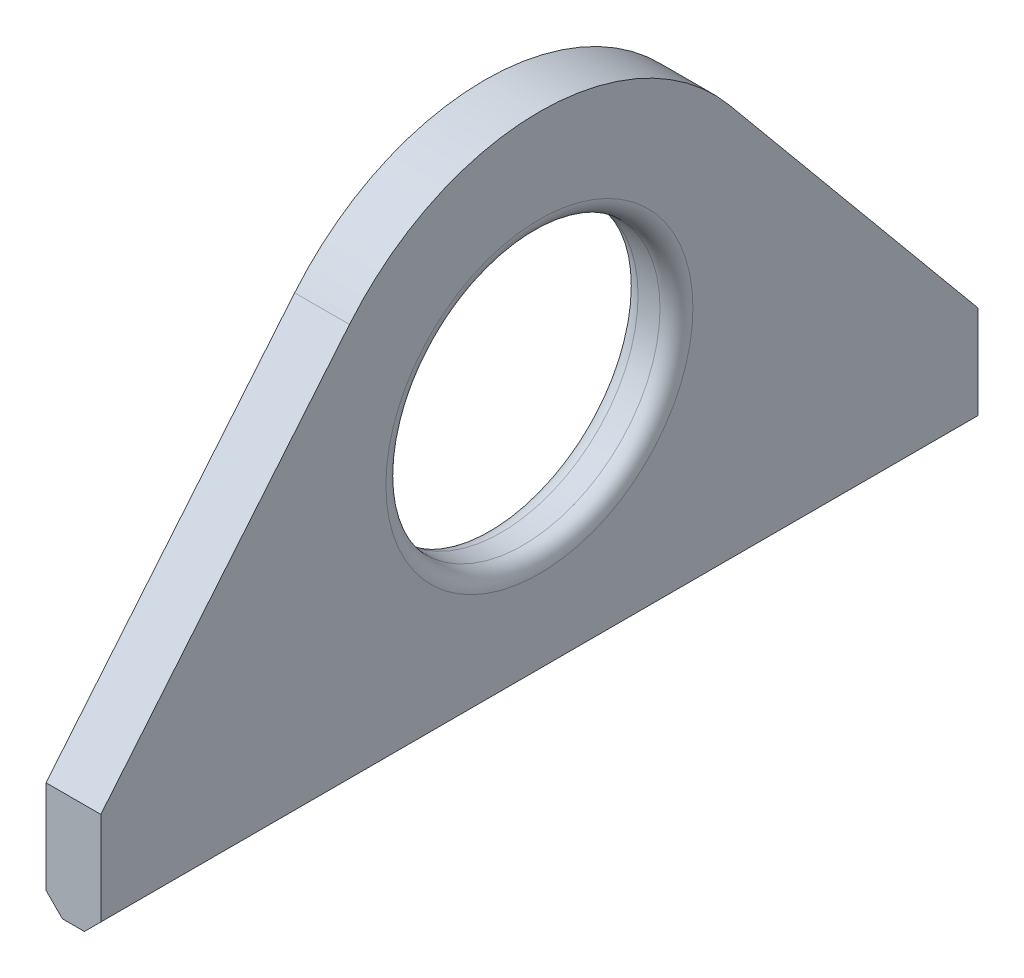
ISO-10303-21;
HEADER;
FILE_DESCRIPTION(('STEP AP214'),'2;1');
FILE_NAME('part.step','',(''),(''),'','','');
FILE_SCHEMA(('AUTOMOTIVE_DESIGN { 1 0 10303 214 1 1 1 1 }'));
ENDSEC;
DATA;
#1=APPLICATION_CONTEXT('core data for automotive mechanical design processes');
#2=APPLICATION_PROTOCOL_DEFINITION('international standard','automotive_design',2000,#1);
#3=PRODUCT_CONTEXT('',#1,'mechanical');
#4=PRODUCT('Part','Part','',(#3));
#5=PRODUCT_RELATED_PRODUCT_CATEGORY('part','',(#4));
#6=PRODUCT_DEFINITION_FORMATION('','',#4);
#7=PRODUCT_DEFINITION_CONTEXT('part definition',#1,'design');
#8=PRODUCT_DEFINITION('design','',#6,#7);
#9=PRODUCT_DEFINITION_SHAPE('','',#8);
#10=(LENGTH_UNIT() NAMED_UNIT(*) SI_UNIT(.MILLI.,.METRE.));
#11=(NAMED_UNIT(*) PLANE_ANGLE_UNIT() SI_UNIT($,.RADIAN.));
#12=(NAMED_UNIT(*) SI_UNIT($,.STERADIAN.) SOLID_ANGLE_UNIT());
#13=UNCERTAINTY_MEASURE_WITH_UNIT(LENGTH_MEASURE(1.E-05),#10,'distance_accuracy_value','');
#14=(GEOMETRIC_REPRESENTATION_CONTEXT(3) GLOBAL_UNCERTAINTY_ASSIGNED_CONTEXT((#13)) GLOBAL_UNIT_ASSIGNED_CONTEXT((#10,
#11,#12)) REPRESENTATION_CONTEXT('',''));
#15=CARTESIAN_POINT('',(0.,0.,0.));
#16=DIRECTION('',(0.,0.,1.));
#17=DIRECTION('',(1.,0.,0.));
#18=AXIS2_PLACEMENT_3D('',#15,#16,#17);
#19=CARTESIAN_POINT('',(-10.,-46.,-80.));
#20=DIRECTION('',(0.,0.,-1.));
#21=DIRECTION('',(-1.,0.,0.));
#22=AXIS2_PLACEMENT_3D('',#19,#20,#21);
#23=PLANE('',#22);
#24=DIRECTION('',(0.,1.,0.));
#25=VECTOR('',#24,1.);
#26=CARTESIAN_POINT('',(0.,-46.,-80.));
#27=LINE('',#26,#25);
#28=CARTESIAN_POINT('',(0.,-43.,-80.));
#29=VERTEX_POINT('',#28);
#30=CARTESIAN_POINT('',(0.,-26.,-80.));
#31=VERTEX_POINT('',#30);
#32=EDGE_CURVE('E134',#29,#31,#27,.T.);
#33=ORIENTED_EDGE('',*,*,#32,.F.);
#34=DIRECTION('',(0.707106781186548,0.707106781186548,0.));
#35=VECTOR('',#34,1.);
#36=CARTESIAN_POINT('',(-6.49999999999999,-49.5,-80.));
#37=LINE('',#36,#35);
#38=CARTESIAN_POINT('',(-2.99999999999998,-46.,-80.));
#39=VERTEX_POINT('',#38);
#40=EDGE_CURVE('E170',#29,#39,#37,.F.);
#41=ORIENTED_EDGE('',*,*,#40,.T.);
#42=DIRECTION('',(1.,0.,0.));
#43=VECTOR('',#42,1.);
#44=CARTESIAN_POINT('',(-10.,-46.,-80.));
#45=LINE('',#44,#43);
#46=CARTESIAN_POINT('',(-7.,-46.,-80.));
#47=VERTEX_POINT('',#46);
#48=EDGE_CURVE('E145',#47,#39,#45,.T.);
#49=ORIENTED_EDGE('',*,*,#48,.F.);
#50=DIRECTION('',(-0.707106781186544,0.707106781186551,0.));
#51=VECTOR('',#50,1.);
#52=CARTESIAN_POINT('',(-8.49999999999999,-44.5,-80.));
#53=LINE('',#52,#51);
#54=CARTESIAN_POINT('',(-10.,-43.,-80.));
#55=VERTEX_POINT('',#54);
#56=EDGE_CURVE('E109',#47,#55,#53,.T.);
#57=ORIENTED_EDGE('',*,*,#56,.T.);
#58=DIRECTION('',(0.,1.,0.));
#59=VECTOR('',#58,1.);
#60=CARTESIAN_POINT('',(-10.,-46.,-80.));
#61=LINE('',#60,#59);
#62=CARTESIAN_POINT('',(-10.,-26.,-80.));
#63=VERTEX_POINT('',#62);
#64=EDGE_CURVE('E103',#55,#63,#61,.T.);
#65=ORIENTED_EDGE('',*,*,#64,.T.);
#66=DIRECTION('',(1.,0.,0.));
#67=VECTOR('',#66,1.);
#68=CARTESIAN_POINT('',(-10.,-26.,-80.));
#69=LINE('',#68,#67);
#70=EDGE_CURVE('E106',#63,#31,#69,.T.);
#71=ORIENTED_EDGE('',*,*,#70,.T.);
#72=EDGE_LOOP('',(#33,#41,#49,#57,#65,#71));
#73=FACE_BOUND('',#72,.T.);
#74=ADVANCED_FACE('F36',(#73),#23,.T.);
#75=CARTESIAN_POINT('',(-10.,-46.,80.));
#76=DIRECTION('',(0.,-1.,0.));
#77=DIRECTION('',(0.,0.,-1.));
#78=AXIS2_PLACEMENT_3D('',#75,#76,#77);
#79=PLANE('',#78);
#80=ORIENTED_EDGE('',*,*,#48,.T.);
#81=DIRECTION('',(0.,0.,1.));
#82=VECTOR('',#81,1.);
#83=CARTESIAN_POINT('',(-2.99999999999998,-46.,80.));
#84=LINE('',#83,#82);
#85=CARTESIAN_POINT('',(-2.99999999999998,-46.,80.));
#86=VERTEX_POINT('',#85);
#87=EDGE_CURVE('E58',#39,#86,#84,.T.);
#88=ORIENTED_EDGE('',*,*,#87,.T.);
#89=DIRECTION('',(1.,0.,0.));
#90=VECTOR('',#89,1.);
#91=CARTESIAN_POINT('',(-10.,-46.,80.));
#92=LINE('',#91,#90);
#93=CARTESIAN_POINT('',(-7.,-46.,80.));
#94=VERTEX_POINT('',#93);
#95=EDGE_CURVE('E148',#94,#86,#92,.T.);
#96=ORIENTED_EDGE('',*,*,#95,.F.);
#97=DIRECTION('',(0.,0.,-1.));
#98=VECTOR('',#97,1.);
#99=CARTESIAN_POINT('',(-7.,-46.,-80.));
#100=LINE('',#99,#98);
#101=EDGE_CURVE('E172',#94,#47,#100,.T.);
#102=ORIENTED_EDGE('',*,*,#101,.T.);
#103=EDGE_LOOP('',(#80,#88,#96,#102));
#104=FACE_BOUND('',#103,.T.);
#105=ADVANCED_FACE('F187',(#104),#79,.T.);
#106=CARTESIAN_POINT('',(-10.,-46.,80.));
#107=DIRECTION('',(0.,0.,1.));
#108=DIRECTION('',(1.,0.,0.));
#109=AXIS2_PLACEMENT_3D('',#106,#107,#108);
#110=PLANE('',#109);
#111=ORIENTED_EDGE('',*,*,#95,.T.);
#112=DIRECTION('',(-0.707106781186548,-0.707106781186548,0.));
#113=VECTOR('',#112,1.);
#114=CARTESIAN_POINT('',(-6.49999999999999,-49.5,80.));
#115=LINE('',#114,#113);
#116=CARTESIAN_POINT('',(0.,-43.,80.));
#117=VERTEX_POINT('',#116);
#118=EDGE_CURVE('E45',#86,#117,#115,.F.);
#119=ORIENTED_EDGE('',*,*,#118,.T.);
#120=DIRECTION('',(0.,-1.,0.));
#121=VECTOR('',#120,1.);
#122=CARTESIAN_POINT('',(0.,-46.,80.));
#123=LINE('',#122,#121);
#124=CARTESIAN_POINT('',(0.,-26.,80.));
#125=VERTEX_POINT('',#124);
#126=EDGE_CURVE('E112',#125,#117,#123,.T.);
#127=ORIENTED_EDGE('',*,*,#126,.F.);
#128=DIRECTION('',(1.,0.,0.));
#129=VECTOR('',#128,1.);
#130=CARTESIAN_POINT('',(-10.,-26.,80.));
#131=LINE('',#130,#129);
#132=CARTESIAN_POINT('',(-10.,-26.,80.));
#133=VERTEX_POINT('',#132);
#134=EDGE_CURVE('E150',#133,#125,#131,.T.);
#135=ORIENTED_EDGE('',*,*,#134,.F.);
#136=DIRECTION('',(0.,-1.,0.));
#137=VECTOR('',#136,1.);
#138=CARTESIAN_POINT('',(-10.,-46.,80.));
#139=LINE('',#138,#137);
#140=CARTESIAN_POINT('',(-10.,-43.,80.));
#141=VERTEX_POINT('',#140);
#142=EDGE_CURVE('E120',#133,#141,#139,.T.);
#143=ORIENTED_EDGE('',*,*,#142,.T.);
#144=DIRECTION('',(0.707106781186544,-0.707106781186551,0.));
#145=VECTOR('',#144,1.);
#146=CARTESIAN_POINT('',(-8.49999999999999,-44.5,80.));
#147=LINE('',#146,#145);
#148=EDGE_CURVE('E176',#141,#94,#147,.T.);
#149=ORIENTED_EDGE('',*,*,#148,.T.);
#150=EDGE_LOOP('',(#111,#119,#127,#135,#143,#149));
#151=FACE_BOUND('',#150,.T.);
#152=ADVANCED_FACE('F180',(#151),#110,.T.);
#153=CARTESIAN_POINT('',(-10.,-26.,80.));
#154=DIRECTION('',(0.,0.638161533577452,0.769902498412672));
#155=DIRECTION('',(0.,-0.769902498412672,0.638161533577452));
#156=AXIS2_PLACEMENT_3D('',#153,#154,#155);
#157=PLANE('',#156);
#158=DIRECTION('',(0.,-0.769902498412672,0.638161533577452));
#159=VECTOR('',#158,1.);
#160=CARTESIAN_POINT('',(0.,-26.,80.));
#161=LINE('',#160,#159);
#162=CARTESIAN_POINT('',(0.,28.7172690109853,34.6456124285702));
#163=VERTEX_POINT('',#162);
#164=EDGE_CURVE('E140',#163,#125,#161,.T.);
#165=ORIENTED_EDGE('',*,*,#164,.F.);
#166=DIRECTION('',(1.,0.,0.));
#167=VECTOR('',#166,1.);
#168=CARTESIAN_POINT('',(-10.,28.7172690109853,34.6456124285702));
#169=LINE('',#168,#167);
#170=CARTESIAN_POINT('',(-10.,28.7172690109853,34.6456124285702));
#171=VERTEX_POINT('',#170);
#172=EDGE_CURVE('E152',#171,#163,#169,.T.);
#173=ORIENTED_EDGE('',*,*,#172,.F.);
#174=DIRECTION('',(0.,-0.769902498412672,0.638161533577452));
#175=VECTOR('',#174,1.);
#176=CARTESIAN_POINT('',(-10.,-26.,80.));
#177=LINE('',#176,#175);
#178=EDGE_CURVE('E128',#171,#133,#177,.T.);
#179=ORIENTED_EDGE('',*,*,#178,.T.);
#180=ORIENTED_EDGE('',*,*,#134,.T.);
#181=EDGE_LOOP('',(#165,#173,#179,#180));
#182=FACE_BOUND('',#181,.T.);
#183=ADVANCED_FACE('F192',(#182),#157,.T.);
#184=CARTESIAN_POINT('',(-10.,0.,0.));
#185=DIRECTION('',(1.,0.,0.));
#186=DIRECTION('',(0.,0.,-1.));
#187=AXIS2_PLACEMENT_3D('',#184,#185,#186);
#188=CYLINDRICAL_SURFACE('',#187,45.);
#189=CARTESIAN_POINT('',(0.,0.,0.));
#190=DIRECTION('',(1.,0.,0.));
#191=DIRECTION('',(0.,0.,-1.));
#192=AXIS2_PLACEMENT_3D('',#189,#190,#191);
#193=CIRCLE('',#192,45.);
#194=CARTESIAN_POINT('',(0.,28.7172690109853,-34.6456124285702));
#195=VERTEX_POINT('',#194);
#196=EDGE_CURVE('E137',#195,#163,#193,.T.);
#197=ORIENTED_EDGE('',*,*,#196,.F.);
#198=DIRECTION('',(1.,0.,0.));
#199=VECTOR('',#198,1.);
#200=CARTESIAN_POINT('',(-10.,28.7172690109853,-34.6456124285702));
#201=LINE('',#200,#199);
#202=CARTESIAN_POINT('',(-10.,28.7172690109853,-34.6456124285702));
#203=VERTEX_POINT('',#202);
#204=EDGE_CURVE('E119',#203,#195,#201,.T.);
#205=ORIENTED_EDGE('',*,*,#204,.F.);
#206=CARTESIAN_POINT('',(-10.,0.,0.));
#207=DIRECTION('',(1.,0.,0.));
#208=DIRECTION('',(0.,0.,-1.));
#209=AXIS2_PLACEMENT_3D('',#206,#207,#208);
#210=CIRCLE('',#209,45.);
#211=EDGE_CURVE('E126',#203,#171,#210,.T.);
#212=ORIENTED_EDGE('',*,*,#211,.T.);
#213=ORIENTED_EDGE('',*,*,#172,.T.);
#214=EDGE_LOOP('',(#197,#205,#212,#213));
#215=FACE_BOUND('',#214,.T.);
#216=ADVANCED_FACE('F195',(#215),#188,.T.);
#217=CARTESIAN_POINT('',(-10.,-26.,-80.));
#218=DIRECTION('',(0.,0.638161533577452,-0.769902498412672));
#219=DIRECTION('',(0.,0.769902498412672,0.638161533577452));
#220=AXIS2_PLACEMENT_3D('',#217,#218,#219);
#221=PLANE('',#220);
#222=DIRECTION('',(0.,0.769902498412672,0.638161533577452));
#223=VECTOR('',#222,1.);
#224=CARTESIAN_POINT('',(0.,-26.,-80.));
#225=LINE('',#224,#223);
#226=EDGE_CURVE('E118',#31,#195,#225,.T.);
#227=ORIENTED_EDGE('',*,*,#226,.F.);
#228=ORIENTED_EDGE('',*,*,#70,.F.);
#229=DIRECTION('',(0.,0.769902498412672,0.638161533577452));
#230=VECTOR('',#229,1.);
#231=CARTESIAN_POINT('',(-10.,-26.,-80.));
#232=LINE('',#231,#230);
#233=EDGE_CURVE('E111',#63,#203,#232,.T.);
#234=ORIENTED_EDGE('',*,*,#233,.T.);
#235=ORIENTED_EDGE('',*,*,#204,.T.);
#236=EDGE_LOOP('',(#227,#228,#234,#235));
#237=FACE_BOUND('',#236,.T.);
#238=ADVANCED_FACE('F116',(#237),#221,.T.);
#239=CARTESIAN_POINT('',(-10.,0.,0.));
#240=DIRECTION('',(1.,0.,0.));
#241=DIRECTION('',(0.,0.,-1.));
#242=AXIS2_PLACEMENT_3D('',#239,#240,#241);
#243=PLANE('',#242);
#244=CARTESIAN_POINT('',(-10.,0.,0.));
#245=DIRECTION('',(1.,0.,0.));
#246=DIRECTION('',(0.,0.,-1.));
#247=AXIS2_PLACEMENT_3D('',#244,#245,#246);
#248=CIRCLE('',#247,28.);
#249=CARTESIAN_POINT('',(-10.,0.,-28.));
#250=VERTEX_POINT('',#249);
#251=EDGE_CURVE('E147',#250,#250,#248,.T.);
#252=ORIENTED_EDGE('',*,*,#251,.T.);
#253=EDGE_LOOP('',(#252));
#254=FACE_BOUND('',#253,.T.);
#255=ORIENTED_EDGE('',*,*,#64,.F.);
#256=DIRECTION('',(0.,0.,1.));
#257=VECTOR('',#256,1.);
#258=CARTESIAN_POINT('',(-10.,-43.,80.));
#259=LINE('',#258,#257);
#260=EDGE_CURVE('E11',#55,#141,#259,.T.);
#261=ORIENTED_EDGE('',*,*,#260,.T.);
#262=ORIENTED_EDGE('',*,*,#142,.F.);
#263=ORIENTED_EDGE('',*,*,#178,.F.);
#264=ORIENTED_EDGE('',*,*,#211,.F.);
#265=ORIENTED_EDGE('',*,*,#233,.F.);
#266=EDGE_LOOP('',(#255,#261,#262,#263,#264,#265));
#267=FACE_BOUND('',#266,.T.);
#268=ADVANCED_FACE('F123',(#254,#267),#243,.F.);
#269=CARTESIAN_POINT('',(0.,0.,0.));
#270=DIRECTION('',(1.,0.,0.));
#271=DIRECTION('',(0.,0.,-1.));
#272=AXIS2_PLACEMENT_3D('',#269,#270,#271);
#273=PLANE('',#272);
#274=CARTESIAN_POINT('',(0.,0.,0.));
#275=DIRECTION('',(1.,0.,0.));
#276=DIRECTION('',(0.,0.,-1.));
#277=AXIS2_PLACEMENT_3D('',#274,#275,#276);
#278=CIRCLE('',#277,28.);
#279=CARTESIAN_POINT('',(0.,0.,-28.));
#280=VERTEX_POINT('',#279);
#281=EDGE_CURVE('E163',#280,#280,#278,.F.);
#282=ORIENTED_EDGE('',*,*,#281,.T.);
#283=EDGE_LOOP('',(#282));
#284=FACE_BOUND('',#283,.T.);
#285=ORIENTED_EDGE('',*,*,#126,.T.);
#286=DIRECTION('',(0.,0.,-1.));
#287=VECTOR('',#286,1.);
#288=CARTESIAN_POINT('',(0.,-43.,0.));
#289=LINE('',#288,#287);
#290=EDGE_CURVE('E166',#117,#29,#289,.T.);
#291=ORIENTED_EDGE('',*,*,#290,.T.);
#292=ORIENTED_EDGE('',*,*,#32,.T.);
#293=ORIENTED_EDGE('',*,*,#226,.T.);
#294=ORIENTED_EDGE('',*,*,#196,.T.);
#295=ORIENTED_EDGE('',*,*,#164,.T.);
#296=EDGE_LOOP('',(#285,#291,#292,#293,#294,#295));
#297=FACE_BOUND('',#296,.T.);
#298=ADVANCED_FACE('F184',(#284,#297),#273,.T.);
#299=CARTESIAN_POINT('',(-10.,0.,0.));
#300=DIRECTION('',(1.,0.,0.));
#301=DIRECTION('',(0.,0.,-1.));
#302=AXIS2_PLACEMENT_3D('',#299,#300,#301);
#303=CYLINDRICAL_SURFACE('',#302,25.);
#304=CARTESIAN_POINT('',(-7.,0.,0.));
#305=DIRECTION('',(1.,0.,0.));
#306=DIRECTION('',(0.,0.,-1.));
#307=AXIS2_PLACEMENT_3D('',#304,#305,#306);
#308=CIRCLE('',#307,25.);
#309=CARTESIAN_POINT('',(-7.,0.,-25.));
#310=VERTEX_POINT('',#309);
#311=EDGE_CURVE('E160',#310,#310,#308,.F.);
#312=ORIENTED_EDGE('',*,*,#311,.T.);
#313=EDGE_LOOP('',(#312));
#314=FACE_BOUND('',#313,.T.);
#315=CARTESIAN_POINT('',(-3.,0.,0.));
#316=DIRECTION('',(1.,0.,0.));
#317=DIRECTION('',(0.,0.,-1.));
#318=AXIS2_PLACEMENT_3D('',#315,#316,#317);
#319=CIRCLE('',#318,25.);
#320=CARTESIAN_POINT('',(-3.,0.,-25.));
#321=VERTEX_POINT('',#320);
#322=EDGE_CURVE('E157',#321,#321,#319,.T.);
#323=ORIENTED_EDGE('',*,*,#322,.T.);
#324=EDGE_LOOP('',(#323));
#325=FACE_BOUND('',#324,.T.);
#326=ADVANCED_FACE('F215',(#314,#325),#303,.F.);
#327=CARTESIAN_POINT('',(-7.,0.,0.));
#328=DIRECTION('',(1.,0.,0.));
#329=DIRECTION('',(0.,0.,-1.));
#330=AXIS2_PLACEMENT_3D('',#327,#328,#329);
#331=TOROIDAL_SURFACE('',#330,28.,3.);
#332=ORIENTED_EDGE('',*,*,#311,.F.);
#333=EDGE_LOOP('',(#332));
#334=FACE_BOUND('',#333,.T.);
#335=ORIENTED_EDGE('',*,*,#251,.F.);
#336=EDGE_LOOP('',(#335));
#337=FACE_BOUND('',#336,.T.);
#338=ADVANCED_FACE('F211',(#334,#337),#331,.T.);
#339=CARTESIAN_POINT('',(-3.,0.,0.));
#340=DIRECTION('',(1.,0.,0.));
#341=DIRECTION('',(0.,0.,-1.));
#342=AXIS2_PLACEMENT_3D('',#339,#340,#341);
#343=TOROIDAL_SURFACE('',#342,28.,3.);
#344=ORIENTED_EDGE('',*,*,#281,.F.);
#345=EDGE_LOOP('',(#344));
#346=FACE_BOUND('',#345,.T.);
#347=ORIENTED_EDGE('',*,*,#322,.F.);
#348=EDGE_LOOP('',(#347));
#349=FACE_BOUND('',#348,.T.);
#350=ADVANCED_FACE('F214',(#346,#349),#343,.T.);
#351=CARTESIAN_POINT('',(0.,-43.,0.));
#352=DIRECTION('',(-0.707106781186548,0.707106781186548,0.));
#353=DIRECTION('',(0.,0.,-1.));
#354=AXIS2_PLACEMENT_3D('',#351,#352,#353);
#355=PLANE('',#354);
#356=ORIENTED_EDGE('',*,*,#118,.F.);
#357=ORIENTED_EDGE('',*,*,#87,.F.);
#358=ORIENTED_EDGE('',*,*,#40,.F.);
#359=ORIENTED_EDGE('',*,*,#290,.F.);
#360=EDGE_LOOP('',(#356,#357,#358,#359));
#361=FACE_BOUND('',#360,.T.);
#362=ADVANCED_FACE('F186',(#361),#355,.F.);
#363=CARTESIAN_POINT('',(-7.,-46.,80.));
#364=DIRECTION('',(-0.707106781186551,-0.707106781186544,0.));
#365=DIRECTION('',(0.,0.,1.));
#366=AXIS2_PLACEMENT_3D('',#363,#364,#365);
#367=PLANE('',#366);
#368=ORIENTED_EDGE('',*,*,#148,.F.);
#369=ORIENTED_EDGE('',*,*,#260,.F.);
#370=ORIENTED_EDGE('',*,*,#56,.F.);
#371=ORIENTED_EDGE('',*,*,#101,.F.);
#372=EDGE_LOOP('',(#368,#369,#370,#371));
#373=FACE_BOUND('',#372,.T.);
#374=ADVANCED_FACE('F39',(#373),#367,.T.);
#375=CLOSED_SHELL('',(#74,#105,#152,#183,#216,#238,#268,#298,#326,#338,#350,#362,#374));
#376=MANIFOLD_SOLID_BREP('B2',#375);
#377=ADVANCED_BREP_SHAPE_REPRESENTATION('',(#18,#376),#14);
#378=SHAPE_DEFINITION_REPRESENTATION(#9,#377);
ENDSEC;
END-ISO-10303-21;
